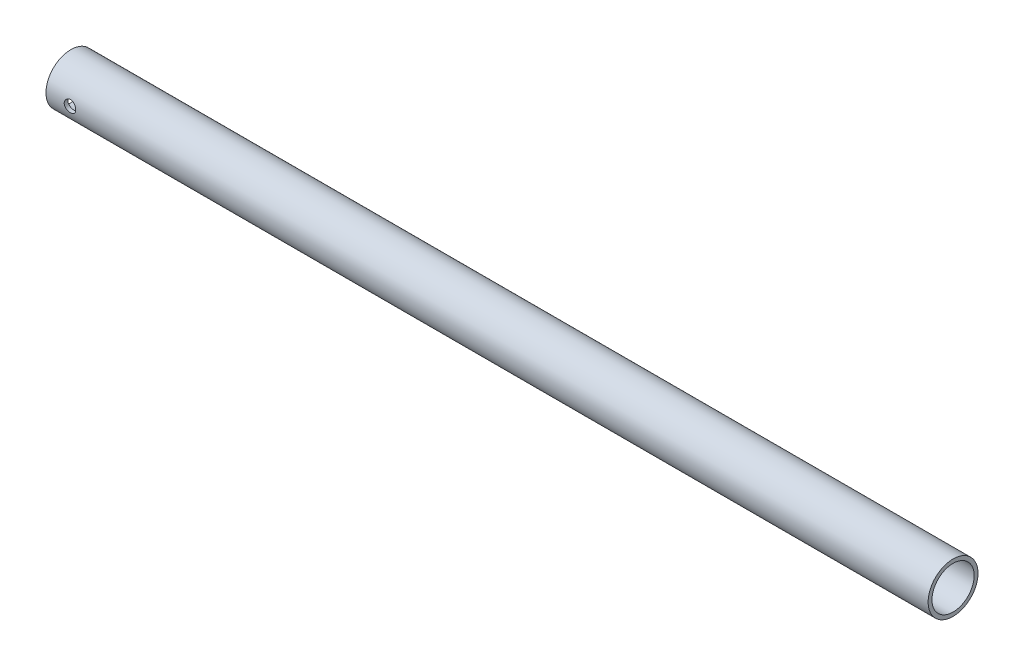
ISO-10303-21;
HEADER;
FILE_DESCRIPTION(('STEP AP214'),'2;1');
FILE_NAME('part.step','',(''),(''),'','','');
FILE_SCHEMA(('AUTOMOTIVE_DESIGN { 1 0 10303 214 1 1 1 1 }'));
ENDSEC;
DATA;
#1=APPLICATION_CONTEXT('core data for automotive mechanical design processes');
#2=APPLICATION_PROTOCOL_DEFINITION('international standard','automotive_design',2000,#1);
#3=PRODUCT_CONTEXT('',#1,'mechanical');
#4=PRODUCT('Part','Part','',(#3));
#5=PRODUCT_RELATED_PRODUCT_CATEGORY('part','',(#4));
#6=PRODUCT_DEFINITION_FORMATION('','',#4);
#7=PRODUCT_DEFINITION_CONTEXT('part definition',#1,'design');
#8=PRODUCT_DEFINITION('design','',#6,#7);
#9=PRODUCT_DEFINITION_SHAPE('','',#8);
#10=(LENGTH_UNIT() NAMED_UNIT(*) SI_UNIT(.MILLI.,.METRE.));
#11=(NAMED_UNIT(*) PLANE_ANGLE_UNIT() SI_UNIT($,.RADIAN.));
#12=(NAMED_UNIT(*) SI_UNIT($,.STERADIAN.) SOLID_ANGLE_UNIT());
#13=UNCERTAINTY_MEASURE_WITH_UNIT(LENGTH_MEASURE(1.E-05),#10,'distance_accuracy_value','');
#14=(GEOMETRIC_REPRESENTATION_CONTEXT(3) GLOBAL_UNCERTAINTY_ASSIGNED_CONTEXT((#13)) GLOBAL_UNIT_ASSIGNED_CONTEXT((#10,
#11,#12)) REPRESENTATION_CONTEXT('',''));
#15=CARTESIAN_POINT('',(0.,0.,0.));
#16=DIRECTION('',(0.,0.,1.));
#17=DIRECTION('',(1.,0.,0.));
#18=AXIS2_PLACEMENT_3D('',#15,#16,#17);
#19=CARTESIAN_POINT('',(460.,0.,0.));
#20=DIRECTION('',(-1.,0.,0.));
#21=DIRECTION('',(0.,0.,1.));
#22=AXIS2_PLACEMENT_3D('',#19,#20,#21);
#23=CYLINDRICAL_SURFACE('',#22,13.);
#24=CARTESIAN_POINT('',(440.,-13.,0.));
#25=CARTESIAN_POINT('',(440.000003596833,-12.9999989044515,0.083956314742746));
#26=CARTESIAN_POINT('',(440.007072415035,-12.999178081572,0.167966345196194));
#27=CARTESIAN_POINT('',(440.035161735033,-12.995982599614,0.333652235419384));
#28=CARTESIAN_POINT('',(440.056197134684,-12.9936062813601,0.415325505475668));
#29=CARTESIAN_POINT('',(440.111594666143,-12.9875677351869,0.573914972249237));
#30=CARTESIAN_POINT('',(440.145948204309,-12.9839063366207,0.650834199520714));
#31=CARTESIAN_POINT('',(440.226988881879,-12.9757057473599,0.797799793787156));
#32=CARTESIAN_POINT('',(440.273673767899,-12.9711667170809,0.867847413269135));
#33=CARTESIAN_POINT('',(440.378288035599,-12.9616943551208,0.999427807179251));
#34=CARTESIAN_POINT('',(440.436263947377,-12.9567594432832,1.06092347729186));
#35=CARTESIAN_POINT('',(440.561714836752,-12.9470643855765,1.17333502414499));
#36=CARTESIAN_POINT('',(440.629190279203,-12.9423042482743,1.22425038284192));
#37=CARTESIAN_POINT('',(440.771962663895,-12.9334819604022,1.31419168733341));
#38=CARTESIAN_POINT('',(440.847281360078,-12.9294218388056,1.35318331715732));
#39=CARTESIAN_POINT('',(441.003452161959,-12.9224797052987,1.41795120910941));
#40=CARTESIAN_POINT('',(441.084304087987,-12.9195976551562,1.44372790011128));
#41=CARTESIAN_POINT('',(441.248863524624,-12.9153528047108,1.48122247723769));
#42=CARTESIAN_POINT('',(441.332556673741,-12.9139832786549,1.49300261981051));
#43=CARTESIAN_POINT('',(441.500742439544,-12.9128978570991,1.50236226854618));
#44=CARTESIAN_POINT('',(441.585235028569,-12.9131819045903,1.49994226427629));
#45=CARTESIAN_POINT('',(441.752189313271,-12.9153653842397,1.48102150197297));
#46=CARTESIAN_POINT('',(441.834658869593,-12.9172569773873,1.46458907258955));
#47=CARTESIAN_POINT('',(441.995661894018,-12.9224301836669,1.41821640637188));
#48=CARTESIAN_POINT('',(442.074195293186,-12.9257118211342,1.38827593305338));
#49=CARTESIAN_POINT('',(442.225310469236,-12.9333043079058,1.31566282618379));
#50=CARTESIAN_POINT('',(442.297877729502,-12.9376175732259,1.27296024500288));
#51=CARTESIAN_POINT('',(442.434841729507,-12.9467853893456,1.176056552901));
#52=CARTESIAN_POINT('',(442.499238150506,-12.9516399612475,1.12185499363065));
#53=CARTESIAN_POINT('',(442.618429283808,-12.9613782949516,1.00311203599151));
#54=CARTESIAN_POINT('',(442.673165291298,-12.9662620604919,0.938511694342143));
#55=CARTESIAN_POINT('',(442.771025612168,-12.9754816969276,0.801008592236024));
#56=CARTESIAN_POINT('',(442.814149905067,-12.9798175668567,0.728105817136094));
#57=CARTESIAN_POINT('',(442.887561712845,-12.9874550212078,0.576023905679869));
#58=CARTESIAN_POINT('',(442.917845838429,-12.9907563324875,0.496843118716625));
#59=CARTESIAN_POINT('',(442.964672527342,-12.9959501177405,0.334473831095745));
#60=CARTESIAN_POINT('',(442.981215638363,-12.9978426478647,0.251285490311377));
#61=CARTESIAN_POINT('',(443.00001527638,-12.999998373659,0.0837704200050181));
#62=CARTESIAN_POINT('',(443.002352728932,-13.0002707984128,-0.000547113543201554));
#63=CARTESIAN_POINT('',(442.992887845389,-12.9991804669134,-0.168372695685013));
#64=CARTESIAN_POINT('',(442.981085764988,-12.9978177402298,-0.251880758889235));
#65=CARTESIAN_POINT('',(442.943744027192,-12.993616027243,-0.415480266956173));
#66=CARTESIAN_POINT('',(442.918242671291,-12.9907811576039,-0.495580568872908));
#67=CARTESIAN_POINT('',(442.854265903771,-12.9839527929212,-0.650367161714373));
#68=CARTESIAN_POINT('',(442.815790111836,-12.9799592639147,-0.72505329385713));
#69=CARTESIAN_POINT('',(442.726758854877,-12.9712363785455,-0.867254744569787));
#70=CARTESIAN_POINT('',(442.676150704087,-12.9665038451426,-0.934736878832498));
#71=CARTESIAN_POINT('',(442.564366255185,-12.9568430886348,-1.06027784673841));
#72=CARTESIAN_POINT('',(442.503189601551,-12.9519148589511,-1.11833636324621));
#73=CARTESIAN_POINT('',(442.371649614664,-12.9423899602444,-1.22366664140005));
#74=CARTESIAN_POINT('',(442.301243356491,-12.9377950067668,-1.27088497439799));
#75=CARTESIAN_POINT('',(442.153452424155,-12.9294843210235,-1.35282617315315));
#76=CARTESIAN_POINT('',(442.076067872123,-12.9257685733744,-1.38754925754464));
#77=CARTESIAN_POINT('',(441.916693846265,-12.9196483466479,-1.44342658284104));
#78=CARTESIAN_POINT('',(441.83471529207,-12.91724089246,-1.46461162925534));
#79=CARTESIAN_POINT('',(441.668335060486,-12.9140010380224,-1.49291104062266));
#80=CARTESIAN_POINT('',(441.583933478036,-12.9131685761467,-1.50002595610951));
#81=CARTESIAN_POINT('',(441.415634346241,-12.9131745631781,-1.49997405326831));
#82=CARTESIAN_POINT('',(441.331736758189,-12.9140031925958,-1.49289116482702));
#83=CARTESIAN_POINT('',(441.166332498007,-12.9172169582806,-1.46482172327173));
#84=CARTESIAN_POINT('',(441.084825827235,-12.9196020954322,-1.44383516225566));
#85=CARTESIAN_POINT('',(440.926523908311,-12.9256572251488,-1.38857911797314));
#86=CARTESIAN_POINT('',(440.849727457419,-12.9293268880955,-1.35431304208043));
#87=CARTESIAN_POINT('',(440.702961599612,-12.9375381901497,-1.27347900341467));
#88=CARTESIAN_POINT('',(440.632992227878,-12.9420798337501,-1.22691097725305));
#89=CARTESIAN_POINT('',(440.501437046671,-12.9515555600008,-1.12248173071089));
#90=CARTESIAN_POINT('',(440.439901078825,-12.9564917239034,-1.06455790771247));
#91=CARTESIAN_POINT('',(440.327388885109,-12.9661816355574,-0.939190054186261));
#92=CARTESIAN_POINT('',(440.276415167591,-12.9709353397599,-0.871743768617521));
#93=CARTESIAN_POINT('',(440.18633643593,-12.9797415177439,-0.728996893197065));
#94=CARTESIAN_POINT('',(440.147270694315,-12.9837916526637,-0.653671391511395));
#95=CARTESIAN_POINT('',(440.082396894961,-12.9907101076694,-0.497527270565871));
#96=CARTESIAN_POINT('',(440.056574207864,-12.993579731148,-0.416714824913402));
#97=CARTESIAN_POINT('',(440.025207145162,-12.9971099824635,-0.279556305332066));
#98=CARTESIAN_POINT('',(440.015767772866,-12.9981885527758,-0.224080319679976));
#99=CARTESIAN_POINT('',(440.003163014719,-12.9996339262189,-0.112410914672196));
#100=CARTESIAN_POINT('',(439.999997591546,-13.0000007335839,-0.0562174995863263));
#101=CARTESIAN_POINT('',(440.,-13.,0.));
#102=B_SPLINE_CURVE_WITH_KNOTS('',3,(#24,#25,#26,#27,#28,#29,#30,#31,#32,#33,#34,#35,#36,#37,
#38,#39,#40,#41,#42,#43,#44,#45,#46,#47,#48,#49,#50,#51,#52,#53,#54,#55,#56,#57,#58,#59,#60,#61,
#62,#63,#64,#65,#66,#67,#68,#69,#70,#71,#72,#73,#74,#75,#76,#77,#78,#79,#80,#81,#82,#83,#84,#85,
#86,#87,#88,#89,#90,#91,#92,#93,#94,#95,#96,#97,#98,#99,#100,#101),.UNSPECIFIED.,.T.,.F.,(4,2,2,
2,2,2,2,2,2,2,2,2,2,2,2,2,2,2,2,2,2,2,2,2,2,2,2,2,2,2,2,2,2,2,2,2,2,2,4),(0.,0.251663624421985,
0.503596125244182,0.755366334321114,1.00709056767774,1.25987498270026,1.51267177188703,
1.7661893968867,2.01969879377992,2.27207631201589,2.52444512928266,2.77559031440118,
3.02673989646919,3.2784835178068,3.53023695652511,3.78347119880921,4.03670588773478,
4.29000737900452,4.54329877367702,4.7951458771551,5.04698842639326,5.29813049175029,
5.54927991940206,5.80154039645168,6.05380936112802,6.30729621090911,6.56077862511557,
6.81368217226283,7.06657582364486,7.31797891068339,7.56938214060571,7.82072090595919,
8.07206096641747,8.32482769676539,8.57765438622375,8.83130609524243,9.0846769930563,
9.25319301127903,9.42170802703678),.UNSPECIFIED.);
#103=CARTESIAN_POINT('',(440.,-13.,0.));
#104=VERTEX_POINT('',#103);
#105=EDGE_CURVE('E61',#104,#104,#102,.T.);
#106=ORIENTED_EDGE('',*,*,#105,.T.);
#107=EDGE_LOOP('',(#106));
#108=FACE_BOUND('',#107,.T.);
#109=CARTESIAN_POINT('',(11.,-13.,0.));
#110=CARTESIAN_POINT('',(11.0000035968329,-12.9999989044515,0.0839563147427421));
#111=CARTESIAN_POINT('',(11.0070724150348,-12.999178081572,0.167966345196187));
#112=CARTESIAN_POINT('',(11.0351617350334,-12.995982599614,0.333652235419372));
#113=CARTESIAN_POINT('',(11.0561971346836,-12.9936062813601,0.415325505475653));
#114=CARTESIAN_POINT('',(11.1115946661428,-12.9875677351869,0.573914972249221));
#115=CARTESIAN_POINT('',(11.1459482043093,-12.9839063366207,0.650834199520699));
#116=CARTESIAN_POINT('',(11.2269888818787,-12.9757057473599,0.79779979378714));
#117=CARTESIAN_POINT('',(11.2736737678988,-12.9711667170809,0.867847413269117));
#118=CARTESIAN_POINT('',(11.3782880355988,-12.9616943551208,0.999427807179226));
#119=CARTESIAN_POINT('',(11.4362639473772,-12.9567594432832,1.06092347729183));
#120=CARTESIAN_POINT('',(11.5617148367524,-12.9470643855765,1.17333502414497));
#121=CARTESIAN_POINT('',(11.6291902792033,-12.9423042482743,1.2242503828419));
#122=CARTESIAN_POINT('',(11.7719626638952,-12.9334819604022,1.3141916873334));
#123=CARTESIAN_POINT('',(11.8472813600777,-12.9294218388056,1.3531833171573));
#124=CARTESIAN_POINT('',(12.0034521619588,-12.9224797052987,1.41795120910938));
#125=CARTESIAN_POINT('',(12.084304087987,-12.9195976551562,1.44372790011126));
#126=CARTESIAN_POINT('',(12.2488635246237,-12.9153528047108,1.48122247723766));
#127=CARTESIAN_POINT('',(12.3325566737406,-12.9139832786549,1.49300261981048));
#128=CARTESIAN_POINT('',(12.5007424395441,-12.9128978570991,1.50236226854616));
#129=CARTESIAN_POINT('',(12.5852350285688,-12.9131819045903,1.49994226427626));
#130=CARTESIAN_POINT('',(12.7521893132711,-12.9153653842397,1.48102150197295));
#131=CARTESIAN_POINT('',(12.8346588695926,-12.9172569773873,1.46458907258954));
#132=CARTESIAN_POINT('',(12.9956618940182,-12.9224301836669,1.41821640637187));
#133=CARTESIAN_POINT('',(13.0741952931857,-12.9257118211342,1.38827593305336));
#134=CARTESIAN_POINT('',(13.2253104692361,-12.9333043079058,1.31566282618376));
#135=CARTESIAN_POINT('',(13.2978777295023,-12.9376175732259,1.27296024500285));
#136=CARTESIAN_POINT('',(13.4348417295072,-12.9467853893456,1.17605655290097));
#137=CARTESIAN_POINT('',(13.4992381505055,-12.9516399612475,1.12185499363063));
#138=CARTESIAN_POINT('',(13.6184292838083,-12.9613782949516,1.0031120359915));
#139=CARTESIAN_POINT('',(13.6731652912979,-12.9662620604919,0.93851169434214));
#140=CARTESIAN_POINT('',(13.7710256121676,-12.9754816969276,0.80100859223603));
#141=CARTESIAN_POINT('',(13.8141499050673,-12.9798175668567,0.728105817136099));
#142=CARTESIAN_POINT('',(13.8875617128448,-12.9874550212078,0.57602390567987));
#143=CARTESIAN_POINT('',(13.9178458384286,-12.9907563324875,0.496843118716625));
#144=CARTESIAN_POINT('',(13.9646725273424,-12.9959501177405,0.334473831095743));
#145=CARTESIAN_POINT('',(13.981215638363,-12.9978426478647,0.251285490311374));
#146=CARTESIAN_POINT('',(14.0000152763796,-12.999998373659,0.083770420005017));
#147=CARTESIAN_POINT('',(14.0023527289319,-13.0002707984128,-0.00054711354320089));
#148=CARTESIAN_POINT('',(13.992887845389,-12.9991804669134,-0.168372695685007));
#149=CARTESIAN_POINT('',(13.9810857649878,-12.9978177402298,-0.251880758889224));
#150=CARTESIAN_POINT('',(13.943744027192,-12.993616027243,-0.415480266956157));
#151=CARTESIAN_POINT('',(13.9182426712912,-12.9907811576039,-0.495580568872891));
#152=CARTESIAN_POINT('',(13.854265903771,-12.9839527929212,-0.650367161714355));
#153=CARTESIAN_POINT('',(13.8157901118356,-12.9799592639147,-0.725053293857113));
#154=CARTESIAN_POINT('',(13.7267588548771,-12.9712363785455,-0.867254744569762));
#155=CARTESIAN_POINT('',(13.6761507040872,-12.9665038451426,-0.934736878832463));
#156=CARTESIAN_POINT('',(13.5643662551848,-12.9568430886348,-1.06027784673838));
#157=CARTESIAN_POINT('',(13.5031896015509,-12.9519148589511,-1.11833636324618));
#158=CARTESIAN_POINT('',(13.3716496146641,-12.9423899602444,-1.22366664140002));
#159=CARTESIAN_POINT('',(13.3012433564911,-12.9377950067668,-1.27088497439797));
#160=CARTESIAN_POINT('',(13.153452424155,-12.9294843210235,-1.35282617315314));
#161=CARTESIAN_POINT('',(13.0760678721235,-12.9257685733744,-1.38754925754463));
#162=CARTESIAN_POINT('',(12.9166938462645,-12.9196483466479,-1.44342658284102));
#163=CARTESIAN_POINT('',(12.8347152920696,-12.91724089246,-1.46461162925533));
#164=CARTESIAN_POINT('',(12.6683350604856,-12.9140010380224,-1.49291104062265));
#165=CARTESIAN_POINT('',(12.5839334780355,-12.9131685761468,-1.50002595610949));
#166=CARTESIAN_POINT('',(12.4156343462406,-12.9131745631781,-1.49997405326828));
#167=CARTESIAN_POINT('',(12.331736758189,-12.9140031925958,-1.49289116482699));
#168=CARTESIAN_POINT('',(12.1663324980068,-12.9172169582806,-1.46482172327171));
#169=CARTESIAN_POINT('',(12.084825827235,-12.9196020954323,-1.44383516225563));
#170=CARTESIAN_POINT('',(11.9265239083107,-12.9256572251488,-1.38857911797313));
#171=CARTESIAN_POINT('',(11.8497274574188,-12.9293268880955,-1.35431304208042));
#172=CARTESIAN_POINT('',(11.7029615996121,-12.9375381901497,-1.27347900341466));
#173=CARTESIAN_POINT('',(11.6329922278779,-12.9420798337501,-1.22691097725304));
#174=CARTESIAN_POINT('',(11.5014370466707,-12.9515555600008,-1.12248173071088));
#175=CARTESIAN_POINT('',(11.439901078825,-12.9564917239034,-1.06455790771248));
#176=CARTESIAN_POINT('',(11.3273888851092,-12.9661816355574,-0.939190054186289));
#177=CARTESIAN_POINT('',(11.2764151675912,-12.9709353397599,-0.871743768617548));
#178=CARTESIAN_POINT('',(11.1863364359297,-12.9797415177439,-0.728996893197091));
#179=CARTESIAN_POINT('',(11.1472706943146,-12.9837916526637,-0.653671391511422));
#180=CARTESIAN_POINT('',(11.0823968949605,-12.9907101076695,-0.497527270565883));
#181=CARTESIAN_POINT('',(11.0565742078644,-12.993579731148,-0.416714824913399));
#182=CARTESIAN_POINT('',(11.0252071451619,-12.9971099824635,-0.27955630533205));
#183=CARTESIAN_POINT('',(11.0157677728663,-12.9981885527758,-0.224080319679962));
#184=CARTESIAN_POINT('',(11.0031630147193,-12.9996339262189,-0.112410914672189));
#185=CARTESIAN_POINT('',(10.9999975915456,-13.0000007335839,-0.0562174995863225));
#186=CARTESIAN_POINT('',(11.,-13.,0.));
#187=B_SPLINE_CURVE_WITH_KNOTS('',3,(#109,#110,#111,#112,#113,#114,#115,#116,#117,#118,#119,
#120,#121,#122,#123,#124,#125,#126,#127,#128,#129,#130,#131,#132,#133,#134,#135,#136,#137,#138,
#139,#140,#141,#142,#143,#144,#145,#146,#147,#148,#149,#150,#151,#152,#153,#154,#155,#156,#157,
#158,#159,#160,#161,#162,#163,#164,#165,#166,#167,#168,#169,#170,#171,#172,#173,#174,#175,#176,
#177,#178,#179,#180,#181,#182,#183,#184,#185,#186),.UNSPECIFIED.,.T.,.F.,(4,2,2,2,2,2,2,2,2,2,2,
2,2,2,2,2,2,2,2,2,2,2,2,2,2,2,2,2,2,2,2,2,2,2,2,2,2,2,4),(0.,0.251663624421978,
0.503596125244171,0.75536633432109,1.00709056767771,1.25987498270023,1.51267177188699,
1.76618939688668,2.0196987937799,2.27207631201581,2.52444512928256,2.77559031440111,
3.02673989646913,3.27848351780672,3.53023695652505,3.78347119880911,4.0367058877347,
4.29000737900445,4.54329877367693,4.79514587715501,5.04698842639317,5.2981304917502,
5.54927991940194,5.80154039645154,6.05380936112789,6.30729621090899,6.56077862511548,
6.81368217226278,7.0665758236448,7.31797891068329,7.56938214060555,7.82072090595902,
8.07206096641734,8.32482769676521,8.57765438622356,8.83130609524227,9.08467699305618,
9.2531930112789,9.42170802703664),.UNSPECIFIED.);
#188=CARTESIAN_POINT('',(11.,-13.,0.));
#189=VERTEX_POINT('',#188);
#190=EDGE_CURVE('E60',#189,#189,#187,.T.);
#191=ORIENTED_EDGE('',*,*,#190,.T.);
#192=EDGE_LOOP('',(#191));
#193=FACE_BOUND('',#192,.T.);
#194=CARTESIAN_POINT('',(460.,0.,0.));
#195=DIRECTION('',(1.,0.,0.));
#196=DIRECTION('',(0.,0.,-1.));
#197=AXIS2_PLACEMENT_3D('',#194,#195,#196);
#198=CIRCLE('',#197,13.);
#199=CARTESIAN_POINT('',(460.,0.,-13.));
#200=VERTEX_POINT('',#199);
#201=EDGE_CURVE('E10',#200,#200,#198,.T.);
#202=ORIENTED_EDGE('',*,*,#201,.F.);
#203=EDGE_LOOP('',(#202));
#204=FACE_BOUND('',#203,.T.);
#205=CARTESIAN_POINT('',(0.,0.,0.));
#206=DIRECTION('',(1.,0.,0.));
#207=DIRECTION('',(0.,0.,-1.));
#208=AXIS2_PLACEMENT_3D('',#205,#206,#207);
#209=CIRCLE('',#208,13.);
#210=CARTESIAN_POINT('',(0.,0.,-13.));
#211=VERTEX_POINT('',#210);
#212=EDGE_CURVE('E44',#211,#211,#209,.T.);
#213=ORIENTED_EDGE('',*,*,#212,.T.);
#214=EDGE_LOOP('',(#213));
#215=FACE_BOUND('',#214,.T.);
#216=CARTESIAN_POINT('',(9.5,0.,13.));
#217=CARTESIAN_POINT('',(9.50000533071178,-0.166152344952669,12.9999969906573));
#218=CARTESIAN_POINT('',(9.51384985362218,-0.332367205973653,12.9967824842909));
#219=CARTESIAN_POINT('',(9.5687952857713,-0.660059866493254,12.9842700075106));
#220=CARTESIAN_POINT('',(9.6099141768828,-0.821534467366725,12.9749680237034));
#221=CARTESIAN_POINT('',(9.71803939788185,-1.13496480129888,12.9513142129353));
#222=CARTESIAN_POINT('',(9.78501717026269,-1.28693082086391,12.936967958219));
#223=CARTESIAN_POINT('',(9.94286453013673,-1.577465910561,12.904766336637));
#224=CARTESIAN_POINT('',(10.0337340374119,-1.71603502567188,12.8869109815535));
#225=CARTESIAN_POINT('',(10.2384905033544,-1.97830470624641,12.8492864660987));
#226=CARTESIAN_POINT('',(10.3527207234048,-2.10173358432239,12.8294913730764));
#227=CARTESIAN_POINT('',(10.6002198531428,-2.32786120795392,12.7903971901517));
#228=CARTESIAN_POINT('',(10.7334906163216,-2.43055793299827,12.7710981487534));
#229=CARTESIAN_POINT('',(11.01733385512,-2.61353391505111,12.7349234835873));
#230=CARTESIAN_POINT('',(11.1681008819513,-2.69351850955545,12.7180809816988));
#231=CARTESIAN_POINT('',(11.4813901973035,-2.82690790660153,12.6891009206901));
#232=CARTESIAN_POINT('',(11.6439109044991,-2.88031627708408,12.6769627300499));
#233=CARTESIAN_POINT('',(11.9731316031644,-2.95812848517193,12.659030692131));
#234=CARTESIAN_POINT('',(12.1397113467331,-2.98301618993589,12.6531311408672));
#235=CARTESIAN_POINT('',(12.4747781740707,-3.00458614092873,12.6480272975283));
#236=CARTESIAN_POINT('',(12.6432649925563,-3.00127226312641,12.6488220853967));
#237=CARTESIAN_POINT('',(12.9737256156487,-2.96692126571465,12.6569216667427));
#238=CARTESIAN_POINT('',(13.1357621626882,-2.93645150630372,12.6640932250769));
#239=CARTESIAN_POINT('',(13.4523595838029,-2.8495548295868,12.683927027642));
#240=CARTESIAN_POINT('',(13.6069199955541,-2.79312630925337,12.6965896109567));
#241=CARTESIAN_POINT('',(13.9057453432819,-2.65540698150097,12.726106644567));
#242=CARTESIAN_POINT('',(14.049908161822,-2.57390258493056,12.7429968648251));
#243=CARTESIAN_POINT('',(14.3227184725787,-2.3884949795051,12.7790447936328));
#244=CARTESIAN_POINT('',(14.451363620518,-2.2845883929106,12.7982028439228));
#245=CARTESIAN_POINT('',(14.6927479001019,-2.05434642172905,12.8371955528176));
#246=CARTESIAN_POINT('',(14.8050277702499,-1.92752990169011,12.8570353769547));
#247=CARTESIAN_POINT('',(15.0068061419507,-1.65663728210681,12.8947363213875));
#248=CARTESIAN_POINT('',(15.0963041350972,-1.51256079749006,12.91259739752));
#249=CARTESIAN_POINT('',(15.2501118282866,-1.21064255594474,12.94439708166));
#250=CARTESIAN_POINT('',(15.3143560313853,-1.0527662865885,12.9583254640484));
#251=CARTESIAN_POINT('',(15.4152722873901,-0.728064792505165,12.980615159728));
#252=CARTESIAN_POINT('',(15.4519488147769,-0.561241024748474,12.9889773764326));
#253=CARTESIAN_POINT('',(15.4960083006963,-0.22731464786328,12.999062058904));
#254=CARTESIAN_POINT('',(15.5040178721195,-0.0602988900254581,13.0009265305377));
#255=CARTESIAN_POINT('',(15.4922219704814,0.272684743158449,12.9982059982626));
#256=CARTESIAN_POINT('',(15.472418609864,0.438652697125492,12.9936214841662));
#257=CARTESIAN_POINT('',(15.4060776067885,0.762715807596045,12.9786082469926));
#258=CARTESIAN_POINT('',(15.3598735173657,0.920882929751393,12.968252478837));
#259=CARTESIAN_POINT('',(15.2424168221512,1.22721924496333,12.9428582085761));
#260=CARTESIAN_POINT('',(15.1711619237282,1.3753875214532,12.9278192778858));
#261=CARTESIAN_POINT('',(15.0043547121581,1.66007523022035,12.8943799217624));
#262=CARTESIAN_POINT('',(14.9084406162299,1.79637682059256,12.8759307059183));
#263=CARTESIAN_POINT('',(14.6955087652826,2.05117436096366,12.8378078382851));
#264=CARTESIAN_POINT('',(14.5784879369158,2.16966771329558,12.8181340084537));
#265=CARTESIAN_POINT('',(14.3237752282431,2.38800205666,12.7792809496474));
#266=CARTESIAN_POINT('',(14.1857060706494,2.48740687177955,12.7601203499969));
#267=CARTESIAN_POINT('',(13.8944682395653,2.66162470892946,12.7249237700036));
#268=CARTESIAN_POINT('',(13.7413002379075,2.73643882449717,12.7088876507294));
#269=CARTESIAN_POINT('',(13.4250480231647,2.85882133736006,12.6819190230073));
#270=CARTESIAN_POINT('',(13.262027740679,2.90654808960746,12.6709569224205));
#271=CARTESIAN_POINT('',(12.9299920143535,2.9738506135118,12.6553320099168));
#272=CARTESIAN_POINT('',(12.7609776616361,2.99343148198756,12.6506680575041));
#273=CARTESIAN_POINT('',(12.4261635458855,3.00365072031913,12.6482450687886));
#274=CARTESIAN_POINT('',(12.2603857787004,2.99498255743034,12.6503205850391));
#275=CARTESIAN_POINT('',(11.9327226426661,2.95051371961671,12.6607654071459));
#276=CARTESIAN_POINT('',(11.7708372167854,2.91471344248812,12.6691346207273));
#277=CARTESIAN_POINT('',(11.4561801784171,2.81734841440311,12.6911387833219));
#278=CARTESIAN_POINT('',(11.3033722785881,2.7558954206715,12.7047508718617));
#279=CARTESIAN_POINT('',(11.0101363869175,2.60906164454194,12.7357136622437));
#280=CARTESIAN_POINT('',(10.8697098517453,2.52367805163026,12.7530648031611));
#281=CARTESIAN_POINT('',(10.6018289428198,2.32915359032528,12.7900365874876));
#282=CARTESIAN_POINT('',(10.4747357609008,2.21952324066575,12.8096993736488));
#283=CARTESIAN_POINT('',(10.2405235047234,1.98059542918642,12.8488080487622));
#284=CARTESIAN_POINT('',(10.1334090901394,1.85129339204876,12.8682538861233));
#285=CARTESIAN_POINT('',(9.94066546410237,1.57438386552311,12.9050799859908));
#286=CARTESIAN_POINT('',(9.85537776342045,1.42653373816977,12.9224254113505));
#287=CARTESIAN_POINT('',(9.71100170118278,1.11821928295074,12.9527409110575));
#288=CARTESIAN_POINT('',(9.65189252979414,0.957765094203868,12.9657144587282));
#289=CARTESIAN_POINT('',(9.57144305288853,0.664420748397534,12.9836544679345));
#290=CARTESIAN_POINT('',(9.54470545794599,0.533052734642015,12.989744579336));
#291=CARTESIAN_POINT('',(9.50898226677056,0.267803260561669,12.9979184490222));
#292=CARTESIAN_POINT('',(9.49999570334532,0.13392193757966,13.0000024255872));
#293=CARTESIAN_POINT('',(9.5,0.,13.));
#294=B_SPLINE_CURVE_WITH_KNOTS('',3,(#216,#217,#218,#219,#220,#221,#222,#223,#224,#225,#226,
#227,#228,#229,#230,#231,#232,#233,#234,#235,#236,#237,#238,#239,#240,#241,#242,#243,#244,#245,
#246,#247,#248,#249,#250,#251,#252,#253,#254,#255,#256,#257,#258,#259,#260,#261,#262,#263,#264,
#265,#266,#267,#268,#269,#270,#271,#272,#273,#274,#275,#276,#277,#278,#279,#280,#281,#282,#283,
#284,#285,#286,#287,#288,#289,#290,#291,#292,#293),.UNSPECIFIED.,.T.,.F.,(4,2,2,2,2,2,2,2,2,2,2,
2,2,2,2,2,2,2,2,2,2,2,2,2,2,2,2,2,2,2,2,2,2,2,2,2,2,2,4),(0.,0.497966622434228,
0.996261878862197,1.49400840494549,1.9917532598344,2.49741860444443,3.00313320634928,
3.51513680218821,4.02707164139241,4.53018632285288,5.03323185836015,5.52600755521466,
6.01881368645778,6.51593939429341,7.01314010983494,7.52235052563831,8.03157230411895,
8.54210619550814,9.05255720476822,9.55178002870641,10.0509649377955,10.5439782351976,
11.0370366645577,11.5377886750691,12.0386136589454,12.5497908111456,13.0609452284513,
13.5690797726974,14.0771222894149,14.5727880288599,15.0684465012649,15.5619677862172,
16.0555470567626,16.5601864742807,17.0649434427466,17.5771721946325,18.088993031651,
18.4903854337741,18.8917559648093),.UNSPECIFIED.);
#295=CARTESIAN_POINT('',(9.5,0.,13.));
#296=VERTEX_POINT('',#295);
#297=EDGE_CURVE('E103',#296,#296,#294,.T.);
#298=ORIENTED_EDGE('',*,*,#297,.F.);
#299=EDGE_LOOP('',(#298));
#300=FACE_BOUND('',#299,.T.);
#301=ADVANCED_FACE('F32',(#108,#193,#204,#215,#300),#23,.T.);
#302=CARTESIAN_POINT('',(460.,0.,0.));
#303=DIRECTION('',(-1.,0.,0.));
#304=DIRECTION('',(0.,0.,1.));
#305=AXIS2_PLACEMENT_3D('',#302,#303,#304);
#306=CYLINDRICAL_SURFACE('',#305,11.);
#307=CARTESIAN_POINT('',(0.,0.,0.));
#308=DIRECTION('',(1.,0.,0.));
#309=DIRECTION('',(0.,0.,-1.));
#310=AXIS2_PLACEMENT_3D('',#307,#308,#309);
#311=CIRCLE('',#310,11.);
#312=CARTESIAN_POINT('',(0.,0.,-11.));
#313=VERTEX_POINT('',#312);
#314=EDGE_CURVE('E52',#313,#313,#311,.T.);
#315=ORIENTED_EDGE('',*,*,#314,.F.);
#316=EDGE_LOOP('',(#315));
#317=FACE_BOUND('',#316,.T.);
#318=CARTESIAN_POINT('',(460.,0.,0.));
#319=DIRECTION('',(1.,0.,0.));
#320=DIRECTION('',(0.,0.,-1.));
#321=AXIS2_PLACEMENT_3D('',#318,#319,#320);
#322=CIRCLE('',#321,11.);
#323=CARTESIAN_POINT('',(460.,0.,-11.));
#324=VERTEX_POINT('',#323);
#325=EDGE_CURVE('E49',#324,#324,#322,.T.);
#326=ORIENTED_EDGE('',*,*,#325,.T.);
#327=EDGE_LOOP('',(#326));
#328=FACE_BOUND('',#327,.T.);
#329=CARTESIAN_POINT('',(12.5,-10.8972473588517,1.5));
#330=CARTESIAN_POINT('',(12.5838343278907,-10.8972486564246,1.49999647698957));
#331=CARTESIAN_POINT('',(12.6677194427675,-10.8982252418974,1.49294806758788));
#332=CARTESIAN_POINT('',(12.8331504746846,-10.9020240848212,1.46494465313417));
#333=CARTESIAN_POINT('',(12.9146939300249,-10.9048482153533,1.44397553464775));
#334=CARTESIAN_POINT('',(13.0730227855142,-10.9120164610863,1.38876442813267));
#335=CARTESIAN_POINT('',(13.149811551595,-10.9163594862124,1.35453195700279));
#336=CARTESIAN_POINT('',(13.2965419687474,-10.9260748678034,1.27378718150828));
#337=CARTESIAN_POINT('',(13.3664846890653,-10.9314470631389,1.2272767989718));
#338=CARTESIAN_POINT('',(13.4980145949851,-10.9426553719722,1.12296630775039));
#339=CARTESIAN_POINT('',(13.5595497603359,-10.9484940481324,1.06510087202417));
#340=CARTESIAN_POINT('',(13.6720678056857,-10.9599544812632,0.939863725934495));
#341=CARTESIAN_POINT('',(13.7230501373424,-10.9655762269495,0.872491521889764));
#342=CARTESIAN_POINT('',(13.8132044048967,-10.9759958911667,0.729823366821417));
#343=CARTESIAN_POINT('',(13.8523288765719,-10.9807904666082,0.654497157455733));
#344=CARTESIAN_POINT('',(13.9173525681087,-10.9889873043899,0.498266779811101));
#345=CARTESIAN_POINT('',(13.9432523683807,-10.9923896278325,0.4173628565063));
#346=CARTESIAN_POINT('',(13.980935031966,-10.9974005480408,0.252807513813705));
#347=CARTESIAN_POINT('',(13.9928046958514,-10.9990201695525,0.169176312601212));
#348=CARTESIAN_POINT('',(14.0023593809641,-11.0003209080163,0.00109450994932823));
#349=CARTESIAN_POINT('',(14.0000450600497,-11.0000021148727,-0.0833560533063686));
#350=CARTESIAN_POINT('',(13.9813665724136,-10.9974708146634,-0.250088067047744));
#351=CARTESIAN_POINT('',(13.9650957704841,-10.9952708921097,-0.332380194950618));
#352=CARTESIAN_POINT('',(13.9191123989843,-10.9892385808313,-0.493054984329789));
#353=CARTESIAN_POINT('',(13.8893995336958,-10.9854061561926,-0.571437559755948));
#354=CARTESIAN_POINT('',(13.8172777975102,-10.9765177622817,-0.722354501083415));
#355=CARTESIAN_POINT('',(13.7748289992064,-10.9714579548357,-0.794869550825005));
#356=CARTESIAN_POINT('',(13.678469450547,-10.9606799547905,-0.93178232970168));
#357=CARTESIAN_POINT('',(13.6245580752574,-10.9549617263023,-0.996179615955343));
#358=CARTESIAN_POINT('',(13.5062819940797,-10.9434509857673,-1.11557819561425));
#359=CARTESIAN_POINT('',(13.441835852491,-10.9376582477788,-1.17049882841786));
#360=CARTESIAN_POINT('',(13.3045980406632,-10.9266970216767,-1.26875693038294));
#361=CARTESIAN_POINT('',(13.2318063344713,-10.9215285362526,-1.31209434964114));
#362=CARTESIAN_POINT('',(13.079866549199,-10.9124011549528,-1.38596314565063));
#363=CARTESIAN_POINT('',(13.0007149016157,-10.9084429442205,-1.41648727235608));
#364=CARTESIAN_POINT('',(12.8383429694276,-10.9021970767288,-1.46378734808377));
#365=CARTESIAN_POINT('',(12.7551229200225,-10.8999093235195,-1.48056409086712));
#366=CARTESIAN_POINT('',(12.5876911564931,-10.8972813444562,-1.49978470836059));
#367=CARTESIAN_POINT('',(12.5034927483805,-10.8969256464885,-1.50234245427448));
#368=CARTESIAN_POINT('',(12.3358685820668,-10.8981610658356,-1.4933536614655));
#369=CARTESIAN_POINT('',(12.252442804228,-10.8997521335324,-1.48180748221547));
#370=CARTESIAN_POINT('',(12.0890782674211,-10.9046876535817,-1.44503477726887));
#371=CARTESIAN_POINT('',(12.0091267072538,-10.9080249489812,-1.41986407756188));
#372=CARTESIAN_POINT('',(11.8545782753703,-10.9160710546304,-1.35661456156867));
#373=CARTESIAN_POINT('',(11.7799816254042,-10.9207799216371,-1.31853521110031));
#374=CARTESIAN_POINT('',(11.6377473937773,-10.9310754038899,-1.23027212104658));
#375=CARTESIAN_POINT('',(11.5701562838736,-10.9366673277264,-1.18001412272531));
#376=CARTESIAN_POINT('',(11.4443274975657,-10.9480824916708,-1.06892459273349));
#377=CARTESIAN_POINT('',(11.3860902560991,-10.9539057425194,-1.00809256966386));
#378=CARTESIAN_POINT('',(11.2802184731906,-10.9651753220023,-0.877082587451357));
#379=CARTESIAN_POINT('',(11.2326590355375,-10.9706188057852,-0.806843655242674));
#380=CARTESIAN_POINT('',(11.1500141109612,-10.9804722800966,-0.659307817820868));
#381=CARTESIAN_POINT('',(11.114928332619,-10.9848822947688,-0.582011077550602));
#382=CARTESIAN_POINT('',(11.0583489740715,-10.9921593898812,-0.422796808531943));
#383=CARTESIAN_POINT('',(11.0368130063536,-10.9950312777662,-0.3408945717743));
#384=CARTESIAN_POINT('',(11.0078069923239,-10.9989285965487,-0.174594562810504));
#385=CARTESIAN_POINT('',(11.0003361847804,-10.9999541273742,-0.0901969259110155));
#386=CARTESIAN_POINT('',(10.9996886672288,-11.0000424834893,0.0779669723968891));
#387=CARTESIAN_POINT('',(11.0063965431173,-10.9991211561704,0.1617328042735));
#388=CARTESIAN_POINT('',(11.0336702656386,-10.9954510037266,0.326934263752212));
#389=CARTESIAN_POINT('',(11.054236088887,-10.9927021816854,0.408369895286135));
#390=CARTESIAN_POINT('',(11.1086035927957,-10.9856844439666,0.566576938829312));
#391=CARTESIAN_POINT('',(11.1423986661649,-10.9814162872104,0.643350657134411));
#392=CARTESIAN_POINT('',(11.2222533022405,-10.9718308359542,0.790155796425701));
#393=CARTESIAN_POINT('',(11.2683131216438,-10.9665135194962,0.860187076253162));
#394=CARTESIAN_POINT('',(11.3718127867224,-10.9553706532258,0.992107364302226));
#395=CARTESIAN_POINT('',(11.4293382679605,-10.9495414757205,1.0539288846877));
#396=CARTESIAN_POINT('',(11.5539568779909,-10.9380600025812,1.16708474239231));
#397=CARTESIAN_POINT('',(11.6210522588865,-10.932407748966,1.21841660422232));
#398=CARTESIAN_POINT('',(11.7632648466861,-10.9218923119176,1.30934306690393));
#399=CARTESIAN_POINT('',(11.8384175458287,-10.9170328791242,1.34888257108231));
#400=CARTESIAN_POINT('',(11.9943237923499,-10.908697184169,1.41472146000491));
#401=CARTESIAN_POINT('',(12.0750712632288,-10.905219448162,1.44103496081361));
#402=CARTESIAN_POINT('',(12.2135113982389,-10.9008677643293,1.47351601613));
#403=CARTESIAN_POINT('',(12.2703382111968,-10.899517060162,1.4834328389276));
#404=CARTESIAN_POINT('',(12.3847686885623,-10.8977064157816,1.49667600965627));
#405=CARTESIAN_POINT('',(12.4423723454053,-10.897246466901,1.50000242171475));
#406=CARTESIAN_POINT('',(12.5,-10.8972473588517,1.5));
#407=B_SPLINE_CURVE_WITH_KNOTS('',3,(#329,#330,#331,#332,#333,#334,#335,#336,#337,#338,#339,
#340,#341,#342,#343,#344,#345,#346,#347,#348,#349,#350,#351,#352,#353,#354,#355,#356,#357,#358,
#359,#360,#361,#362,#363,#364,#365,#366,#367,#368,#369,#370,#371,#372,#373,#374,#375,#376,#377,
#378,#379,#380,#381,#382,#383,#384,#385,#386,#387,#388,#389,#390,#391,#392,#393,#394,#395,#396,
#397,#398,#399,#400,#401,#402,#403,#404,#405,#406),.UNSPECIFIED.,.T.,.F.,(4,2,2,2,2,2,2,2,2,2,2,
2,2,2,2,2,2,2,2,2,2,2,2,2,2,2,2,2,2,2,2,2,2,2,2,2,2,2,4),(0.,0.251292413652352,
0.502839988614744,0.754207403054463,1.00553549494109,1.25835430174808,1.51118624213233,
1.76501723524539,2.01883708715133,2.27107826705025,2.52330774799944,2.77386293073417,
3.02442362581395,3.27577819064359,3.5271464627132,3.78055871311719,4.03397205526461,
4.28752859167035,4.5410704869265,4.79257896376821,5.04408103043815,5.29456029222846,
5.5450499205463,5.79710712919646,6.04917605465383,6.30296596167166,6.55674993906902,
6.80973601099934,7.0627083904752,7.31362951480923,7.56455021573112,7.81534575497387,
8.06614654369506,8.31889590223292,8.57170483921672,8.82567709259417,9.07937770366513,
9.25211760261269,9.42485582072184),.UNSPECIFIED.);
#408=CARTESIAN_POINT('',(12.5,-10.8972473588517,1.5));
#409=VERTEX_POINT('',#408);
#410=EDGE_CURVE('E55',#409,#409,#407,.T.);
#411=ORIENTED_EDGE('',*,*,#410,.F.);
#412=EDGE_LOOP('',(#411));
#413=FACE_BOUND('',#412,.T.);
#414=CARTESIAN_POINT('',(441.5,-10.8972473588517,1.50000000000002));
#415=CARTESIAN_POINT('',(441.583834327891,-10.8972486564246,1.49999647698959));
#416=CARTESIAN_POINT('',(441.667719442768,-10.8982252418974,1.49294806758791));
#417=CARTESIAN_POINT('',(441.833150474685,-10.9020240848212,1.4649446531342));
#418=CARTESIAN_POINT('',(441.914693930025,-10.9048482153533,1.44397553464778));
#419=CARTESIAN_POINT('',(442.073022785514,-10.9120164610863,1.3887644281327));
#420=CARTESIAN_POINT('',(442.149811551595,-10.9163594862124,1.35453195700282));
#421=CARTESIAN_POINT('',(442.296541968747,-10.9260748678034,1.27378718150832));
#422=CARTESIAN_POINT('',(442.366484689065,-10.9314470631388,1.22727679897184));
#423=CARTESIAN_POINT('',(442.498014594985,-10.9426553719722,1.12296630775043));
#424=CARTESIAN_POINT('',(442.559549760336,-10.9484940481324,1.06510087202421));
#425=CARTESIAN_POINT('',(442.672067805686,-10.9599544812632,0.939863725934544));
#426=CARTESIAN_POINT('',(442.723050137342,-10.9655762269495,0.872491521889814));
#427=CARTESIAN_POINT('',(442.813204404897,-10.9759958911667,0.729823366821471));
#428=CARTESIAN_POINT('',(442.852328876572,-10.9807904666082,0.654497157455789));
#429=CARTESIAN_POINT('',(442.917352568109,-10.9889873043899,0.498266779811155));
#430=CARTESIAN_POINT('',(442.943252368381,-10.9923896278325,0.417362856506349));
#431=CARTESIAN_POINT('',(442.980935031966,-10.9974005480408,0.252807513813746));
#432=CARTESIAN_POINT('',(442.992804695851,-10.9990201695525,0.169176312601251));
#433=CARTESIAN_POINT('',(443.002359380964,-11.0003209080163,0.00109450994936148));
#434=CARTESIAN_POINT('',(443.00004506005,-11.0000021148727,-0.0833560533063385));
#435=CARTESIAN_POINT('',(442.981366572414,-10.9974708146634,-0.250088067047722));
#436=CARTESIAN_POINT('',(442.965095770484,-10.9952708921097,-0.3323801949506));
#437=CARTESIAN_POINT('',(442.919112398984,-10.9892385808313,-0.493054984329777));
#438=CARTESIAN_POINT('',(442.889399533696,-10.9854061561926,-0.571437559755938));
#439=CARTESIAN_POINT('',(442.81727779751,-10.9765177622817,-0.722354501083411));
#440=CARTESIAN_POINT('',(442.774828999206,-10.9714579548358,-0.794869550825006));
#441=CARTESIAN_POINT('',(442.678469450547,-10.9606799547905,-0.931782329701684));
#442=CARTESIAN_POINT('',(442.624558075257,-10.9549617263022,-0.996179615955348));
#443=CARTESIAN_POINT('',(442.50628199408,-10.9434509857673,-1.11557819561425));
#444=CARTESIAN_POINT('',(442.441835852491,-10.9376582477788,-1.17049882841786));
#445=CARTESIAN_POINT('',(442.304598040663,-10.9266970216767,-1.26875693038294));
#446=CARTESIAN_POINT('',(442.231806334471,-10.9215285362526,-1.31209434964115));
#447=CARTESIAN_POINT('',(442.079866549199,-10.9124011549528,-1.38596314565065));
#448=CARTESIAN_POINT('',(442.000714901616,-10.9084429442205,-1.4164872723561));
#449=CARTESIAN_POINT('',(441.838342969428,-10.9021970767287,-1.46378734808378));
#450=CARTESIAN_POINT('',(441.755122920023,-10.8999093235195,-1.48056409086714));
#451=CARTESIAN_POINT('',(441.587691156493,-10.8972813444562,-1.49978470836062));
#452=CARTESIAN_POINT('',(441.50349274838,-10.8969256464884,-1.50234245427451));
#453=CARTESIAN_POINT('',(441.335868582067,-10.8981610658356,-1.49335366146552));
#454=CARTESIAN_POINT('',(441.252442804228,-10.8997521335324,-1.48180748221549));
#455=CARTESIAN_POINT('',(441.089078267421,-10.9046876535817,-1.4450347772689));
#456=CARTESIAN_POINT('',(441.009126707254,-10.9080249489812,-1.41986407756191));
#457=CARTESIAN_POINT('',(440.85457827537,-10.9160710546304,-1.35661456156871));
#458=CARTESIAN_POINT('',(440.779981625404,-10.9207799216371,-1.31853521110036));
#459=CARTESIAN_POINT('',(440.637747393777,-10.9310754038899,-1.23027212104663));
#460=CARTESIAN_POINT('',(440.570156283874,-10.9366673277264,-1.18001412272537));
#461=CARTESIAN_POINT('',(440.444327497566,-10.9480824916708,-1.06892459273354));
#462=CARTESIAN_POINT('',(440.386090256099,-10.9539057425194,-1.00809256966389));
#463=CARTESIAN_POINT('',(440.280218473191,-10.9651753220023,-0.877082587451372));
#464=CARTESIAN_POINT('',(440.232659035537,-10.9706188057852,-0.806843655242688));
#465=CARTESIAN_POINT('',(440.150014110961,-10.9804722800966,-0.659307817820889));
#466=CARTESIAN_POINT('',(440.114928332619,-10.9848822947688,-0.58201107755063));
#467=CARTESIAN_POINT('',(440.058348974071,-10.9921593898812,-0.422796808531974));
#468=CARTESIAN_POINT('',(440.036813006354,-10.9950312777662,-0.340894571774326));
#469=CARTESIAN_POINT('',(440.007806992324,-10.9989285965487,-0.174594562810524));
#470=CARTESIAN_POINT('',(440.00033618478,-10.9999541273742,-0.0901969259110341));
#471=CARTESIAN_POINT('',(439.999688667229,-11.0000424834893,0.0779669723968674));
#472=CARTESIAN_POINT('',(440.006396543117,-10.9991211561704,0.161732804273474));
#473=CARTESIAN_POINT('',(440.033670265639,-10.9954510037266,0.32693426375219));
#474=CARTESIAN_POINT('',(440.054236088887,-10.9927021816854,0.408369895286121));
#475=CARTESIAN_POINT('',(440.108603592796,-10.9856844439666,0.566576938829298));
#476=CARTESIAN_POINT('',(440.142398666165,-10.9814162872104,0.643350657134388));
#477=CARTESIAN_POINT('',(440.22225330224,-10.9718308359542,0.79015579642568));
#478=CARTESIAN_POINT('',(440.268313121644,-10.9665135194962,0.860187076253151));
#479=CARTESIAN_POINT('',(440.371812786722,-10.9553706532258,0.99210736430222));
#480=CARTESIAN_POINT('',(440.42933826796,-10.9495414757205,1.05392888468769));
#481=CARTESIAN_POINT('',(440.553956877991,-10.9380600025812,1.1670847423923));
#482=CARTESIAN_POINT('',(440.621052258886,-10.932407748966,1.21841660422233));
#483=CARTESIAN_POINT('',(440.763264846686,-10.9218923119176,1.30934306690395));
#484=CARTESIAN_POINT('',(440.838417545829,-10.9170328791241,1.34888257108233));
#485=CARTESIAN_POINT('',(440.99432379235,-10.908697184169,1.41472146000493));
#486=CARTESIAN_POINT('',(441.075071263229,-10.905219448162,1.44103496081363));
#487=CARTESIAN_POINT('',(441.213511398239,-10.9008677643293,1.47351601613002));
#488=CARTESIAN_POINT('',(441.270338211197,-10.8995170601619,1.48343283892762));
#489=CARTESIAN_POINT('',(441.384768688562,-10.8977064157815,1.4966760096563));
#490=CARTESIAN_POINT('',(441.442372345405,-10.897246466901,1.50000242171477));
#491=CARTESIAN_POINT('',(441.5,-10.8972473588517,1.50000000000002));
#492=B_SPLINE_CURVE_WITH_KNOTS('',3,(#414,#415,#416,#417,#418,#419,#420,#421,#422,#423,#424,
#425,#426,#427,#428,#429,#430,#431,#432,#433,#434,#435,#436,#437,#438,#439,#440,#441,#442,#443,
#444,#445,#446,#447,#448,#449,#450,#451,#452,#453,#454,#455,#456,#457,#458,#459,#460,#461,#462,
#463,#464,#465,#466,#467,#468,#469,#470,#471,#472,#473,#474,#475,#476,#477,#478,#479,#480,#481,
#482,#483,#484,#485,#486,#487,#488,#489,#490,#491),.UNSPECIFIED.,.T.,.F.,(4,2,2,2,2,2,2,2,2,2,2,
2,2,2,2,2,2,2,2,2,2,2,2,2,2,2,2,2,2,2,2,2,2,2,2,2,2,2,4),(0.,0.251292413652341,0.50283998861474,
0.754207403054393,1.0055354949411,1.25835430174807,1.5111862421323,1.76501723524535,
2.01883708715131,2.27107826705025,2.52330774799944,2.77386293073417,3.02442362581397,
3.27577819064364,3.52714646271323,3.7805587131172,4.03397205526462,4.2875285916704,
4.54107048692653,4.79257896376828,5.04408103043821,5.29456029222848,5.54504992054629,
5.79710712919647,6.0491760546539,6.30296596167173,6.55674993906909,6.80973601099942,
7.06270839047527,7.3136295148093,7.56455021573119,7.81534575497395,8.06614654369512,
8.31889590223302,8.57170483921682,8.8256770925943,9.07937770366522,9.25211760261283,
9.42485582072197),.UNSPECIFIED.);
#493=CARTESIAN_POINT('',(441.5,-10.8972473588517,1.50000000000002));
#494=VERTEX_POINT('',#493);
#495=EDGE_CURVE('E62',#494,#494,#492,.T.);
#496=ORIENTED_EDGE('',*,*,#495,.F.);
#497=EDGE_LOOP('',(#496));
#498=FACE_BOUND('',#497,.T.);
#499=CARTESIAN_POINT('',(15.5,0.,11.));
#500=CARTESIAN_POINT('',(15.499996374778,0.165241826664386,10.9999976543482));
#501=CARTESIAN_POINT('',(15.4863018728332,0.330521957625414,10.9962401452152));
#502=CARTESIAN_POINT('',(15.4319883393936,0.656311860315393,10.981615961709));
#503=CARTESIAN_POINT('',(15.3913572167428,0.816819455954529,10.97074609481));
#504=CARTESIAN_POINT('',(15.2845965365231,1.12831525211079,10.9430954434827));
#505=CARTESIAN_POINT('',(15.2185006946762,1.27931573394033,10.9263224773879));
#506=CARTESIAN_POINT('',(15.0628141346752,1.56808899231944,10.888633088257));
#507=CARTESIAN_POINT('',(14.9732215672921,1.70586072657955,10.8677163391303));
#508=CARTESIAN_POINT('',(14.7708003270655,1.96759389514652,10.8234279408412));
#509=CARTESIAN_POINT('',(14.6575091182916,2.09119025833987,10.8000128298086));
#510=CARTESIAN_POINT('',(14.4118947279402,2.31788587364956,10.7536422587013));
#511=CARTESIAN_POINT('',(14.2795689791954,2.42098235649443,10.7306868611041));
#512=CARTESIAN_POINT('',(13.9966975048411,2.60555589078995,10.6873876832732));
#513=CARTESIAN_POINT('',(13.8458657101274,2.68660853675173,10.6670986011725));
#514=CARTESIAN_POINT('',(13.5320723436012,2.82205832722455,10.6320701482383));
#515=CARTESIAN_POINT('',(13.369113130223,2.87646063893688,10.6173297017151));
#516=CARTESIAN_POINT('',(13.0397442099751,2.95578912882535,10.5955169438548));
#517=CARTESIAN_POINT('',(12.8735061036762,2.98137921086458,10.5882722456757));
#518=CARTESIAN_POINT('',(12.5389506339824,3.00442728818267,10.5817565816817));
#519=CARTESIAN_POINT('',(12.370633685,3.00189080281765,10.5824840514652));
#520=CARTESIAN_POINT('',(12.0419168980675,2.96928383560602,10.5916764975091));
#521=CARTESIAN_POINT('',(11.8814295307955,2.94002147337864,10.5999143662734));
#522=CARTESIAN_POINT('',(11.5677334279544,2.85608967743614,10.6228351158812));
#523=CARTESIAN_POINT('',(11.4145252990674,2.80141813009295,10.6375185328831));
#524=CARTESIAN_POINT('',(11.1176529589051,2.6675725965294,10.6718723658465));
#525=CARTESIAN_POINT('',(10.9741215979328,2.58811903765895,10.6915991952828));
#526=CARTESIAN_POINT('',(10.7021471051807,2.40715976044348,10.7337873759558));
#527=CARTESIAN_POINT('',(10.5737070743225,2.30564952212418,10.756249287265));
#528=CARTESIAN_POINT('',(10.3309496203871,2.07934693365792,10.8023178998121));
#529=CARTESIAN_POINT('',(10.2172651014221,1.9538772923345,10.8259374859423));
#530=CARTESIAN_POINT('',(10.0124180700444,1.68536402357727,10.8709729541596));
#531=CARTESIAN_POINT('',(9.92125652790076,1.54231963943711,10.8923887412858));
#532=CARTESIAN_POINT('',(9.76374665445015,1.24170790747925,10.9307455624252));
#533=CARTESIAN_POINT('',(9.69751732283211,1.08407527483555,10.9476650257461));
#534=CARTESIAN_POINT('',(9.59268405497171,0.759345377428781,10.9749671228522));
#535=CARTESIAN_POINT('',(9.55407379511172,0.592250288635364,10.9853512528913));
#536=CARTESIAN_POINT('',(9.50657876440605,0.258736340966501,10.9981845755262));
#537=CARTESIAN_POINT('',(9.49683400935927,0.0924485955679607,11.0008632625074));
#538=CARTESIAN_POINT('',(9.50496549502686,-0.239386731275946,10.9986460317028));
#539=CARTESIAN_POINT('',(9.52283873923299,-0.404934391065018,10.9937509356601));
#540=CARTESIAN_POINT('',(9.58499500540626,-0.727490195479108,10.977084785319));
#541=CARTESIAN_POINT('',(9.62879438551397,-0.884598648545338,10.965439729442));
#542=CARTESIAN_POINT('',(9.74099448928101,-1.18921973489727,10.9365984707135));
#543=CARTESIAN_POINT('',(9.80939793932271,-1.33673130261004,10.9194016526918));
#544=CARTESIAN_POINT('',(9.97043288457122,-1.62128232238913,10.8808314765631));
#545=CARTESIAN_POINT('',(10.0635269745225,-1.75804920482497,10.8593805909887));
#546=CARTESIAN_POINT('',(10.270722575091,-2.01432044026183,10.8147797682096));
#547=CARTESIAN_POINT('',(10.3848284323171,-2.133821212356,10.7916294800542));
#548=CARTESIAN_POINT('',(10.6348280760676,-2.35582120688548,10.7453880311357));
#549=CARTESIAN_POINT('',(10.7712667645499,-2.45771255494154,10.7223188995483));
#550=CARTESIAN_POINT('',(11.0597972944466,-2.63717164416209,10.6796005238857));
#551=CARTESIAN_POINT('',(11.2118885092451,-2.71474035852927,10.6599511429925));
#552=CARTESIAN_POINT('',(11.5266812564644,-2.84277116633765,10.6265249735947));
#553=CARTESIAN_POINT('',(11.6893165209606,-2.8933870461064,10.6127149622546));
#554=CARTESIAN_POINT('',(12.0212336759556,-2.9664183443807,10.5925362923412));
#555=CARTESIAN_POINT('',(12.1905137590686,-2.98884137725659,10.586165624571));
#556=CARTESIAN_POINT('',(12.5246768076706,-3.00439791154423,10.5817601934995));
#557=CARTESIAN_POINT('',(12.6895111774958,-2.99851066433394,10.5834467188085));
#558=CARTESIAN_POINT('',(13.0157412955056,-2.95989675286934,10.5943100332908));
#559=CARTESIAN_POINT('',(13.1771371398994,-2.92717084057027,10.6034866126106));
#560=CARTESIAN_POINT('',(13.4906126315378,-2.83638816870609,10.6281263302192));
#561=CARTESIAN_POINT('',(13.6427595064796,-2.77854790898354,10.6435356626191));
#562=CARTESIAN_POINT('',(13.9353065536306,-2.63934609082671,10.6789037996565));
#563=CARTESIAN_POINT('',(14.0757048021314,-2.55798069008885,10.6988633473566));
#564=CARTESIAN_POINT('',(14.3454211953842,-2.3711086196973,10.7418475876651));
#565=CARTESIAN_POINT('',(14.4742674096859,-2.26493803644257,10.7649475169129));
#566=CARTESIAN_POINT('',(14.7126328135895,-2.0327202239854,10.8111998098094));
#567=CARTESIAN_POINT('',(14.8221472480107,-1.90666811877597,10.834352184944));
#568=CARTESIAN_POINT('',(15.0211892290387,-1.63481545137218,10.8787291835493));
#569=CARTESIAN_POINT('',(15.1102069617339,-1.48863173252505,10.8998981550767));
#570=CARTESIAN_POINT('',(15.262264872423,-1.18279979967855,10.9373052756075));
#571=CARTESIAN_POINT('',(15.3253209611087,-1.02315990484244,10.9535464430238));
#572=CARTESIAN_POINT('',(15.415879019958,-0.720200202436422,10.9772838799153));
#573=CARTESIAN_POINT('',(15.4473491024834,-0.578129280524936,10.9857389536219));
#574=CARTESIAN_POINT('',(15.4894100506377,-0.290715215882968,10.9970977432871));
#575=CARTESIAN_POINT('',(15.5000031893096,-0.145372431129894,11.0000020636004));
#576=CARTESIAN_POINT('',(15.5,0.,11.));
#577=B_SPLINE_CURVE_WITH_KNOTS('',3,(#499,#500,#501,#502,#503,#504,#505,#506,#507,#508,#509,
#510,#511,#512,#513,#514,#515,#516,#517,#518,#519,#520,#521,#522,#523,#524,#525,#526,#527,#528,
#529,#530,#531,#532,#533,#534,#535,#536,#537,#538,#539,#540,#541,#542,#543,#544,#545,#546,#547,
#548,#549,#550,#551,#552,#553,#554,#555,#556,#557,#558,#559,#560,#561,#562,#563,#564,#565,#566,
#567,#568,#569,#570,#571,#572,#573,#574,#575,#576),.UNSPECIFIED.,.T.,.F.,(4,2,2,2,2,2,2,2,2,2,2,
2,2,2,2,2,2,2,2,2,2,2,2,2,2,2,2,2,2,2,2,2,2,2,2,2,2,2,4),(0.,0.495192213709793,0.9906068571026,
1.48536780484116,1.98016770272941,2.48571756446357,2.99133567318647,3.50609187300439,
4.02074822781993,4.52328609721851,5.02572535393075,5.51345773349774,6.00123069167434,
6.49471853535856,6.98830760278243,7.4987705710155,8.00925552568847,8.52214699472056,
9.03492099533888,9.53225622686165,10.029537502105,10.5178222240039,11.0061610695167,
11.5043893801936,12.0027208731201,12.5158014612974,13.0288615173582,13.5389619291417,
14.0489245425547,14.5413770446734,15.0338157499215,15.5220911132461,16.0104462704815,
16.5137802279716,17.0172378222292,17.5321174459109,18.0466810522785,18.4823766419936,
18.9180247913559),.UNSPECIFIED.);
#578=CARTESIAN_POINT('',(15.5,0.,11.));
#579=VERTEX_POINT('',#578);
#580=EDGE_CURVE('E36',#579,#579,#577,.T.);
#581=ORIENTED_EDGE('',*,*,#580,.T.);
#582=EDGE_LOOP('',(#581));
#583=FACE_BOUND('',#582,.T.);
#584=ADVANCED_FACE('F66',(#317,#328,#413,#498,#583),#306,.F.);
#585=CARTESIAN_POINT('',(460.,0.,0.));
#586=DIRECTION('',(1.,0.,0.));
#587=DIRECTION('',(0.,0.,-1.));
#588=AXIS2_PLACEMENT_3D('',#585,#586,#587);
#589=PLANE('',#588);
#590=ORIENTED_EDGE('',*,*,#201,.T.);
#591=EDGE_LOOP('',(#590));
#592=FACE_BOUND('',#591,.T.);
#593=ORIENTED_EDGE('',*,*,#325,.F.);
#594=EDGE_LOOP('',(#593));
#595=FACE_BOUND('',#594,.T.);
#596=ADVANCED_FACE('F93',(#592,#595),#589,.T.);
#597=CARTESIAN_POINT('',(0.,0.,0.));
#598=DIRECTION('',(1.,0.,0.));
#599=DIRECTION('',(0.,0.,-1.));
#600=AXIS2_PLACEMENT_3D('',#597,#598,#599);
#601=PLANE('',#600);
#602=ORIENTED_EDGE('',*,*,#212,.F.);
#603=EDGE_LOOP('',(#602));
#604=FACE_BOUND('',#603,.T.);
#605=ORIENTED_EDGE('',*,*,#314,.T.);
#606=EDGE_LOOP('',(#605));
#607=FACE_BOUND('',#606,.T.);
#608=ADVANCED_FACE('F73',(#604,#607),#601,.F.);
#609=CARTESIAN_POINT('',(12.5,-13.,0.));
#610=DIRECTION('',(0.,1.,0.));
#611=DIRECTION('',(0.,0.,1.));
#612=AXIS2_PLACEMENT_3D('',#609,#610,#611);
#613=CYLINDRICAL_SURFACE('',#612,1.5);
#614=ORIENTED_EDGE('',*,*,#410,.T.);
#615=EDGE_LOOP('',(#614));
#616=FACE_BOUND('',#615,.T.);
#617=ORIENTED_EDGE('',*,*,#190,.F.);
#618=EDGE_LOOP('',(#617));
#619=FACE_BOUND('',#618,.T.);
#620=ADVANCED_FACE('F69',(#616,#619),#613,.F.);
#621=CARTESIAN_POINT('',(441.5,-13.,0.));
#622=DIRECTION('',(0.,1.,0.));
#623=DIRECTION('',(0.,0.,1.));
#624=AXIS2_PLACEMENT_3D('',#621,#622,#623);
#625=CYLINDRICAL_SURFACE('',#624,1.50000000000002);
#626=ORIENTED_EDGE('',*,*,#495,.T.);
#627=EDGE_LOOP('',(#626));
#628=FACE_BOUND('',#627,.T.);
#629=ORIENTED_EDGE('',*,*,#105,.F.);
#630=EDGE_LOOP('',(#629));
#631=FACE_BOUND('',#630,.T.);
#632=ADVANCED_FACE('F72',(#628,#631),#625,.F.);
#633=CARTESIAN_POINT('',(12.5,0.,13.));
#634=DIRECTION('',(0.,0.,-1.));
#635=DIRECTION('',(-1.,0.,0.));
#636=AXIS2_PLACEMENT_3D('',#633,#634,#635);
#637=CYLINDRICAL_SURFACE('',#636,3.);
#638=ORIENTED_EDGE('',*,*,#580,.F.);
#639=EDGE_LOOP('',(#638));
#640=FACE_BOUND('',#639,.T.);
#641=ORIENTED_EDGE('',*,*,#297,.T.);
#642=EDGE_LOOP('',(#641));
#643=FACE_BOUND('',#642,.T.);
#644=ADVANCED_FACE('F109',(#640,#643),#637,.F.);
#645=CLOSED_SHELL('',(#301,#584,#596,#608,#620,#632,#644));
#646=MANIFOLD_SOLID_BREP('B2',#645);
#647=ADVANCED_BREP_SHAPE_REPRESENTATION('',(#18,#646),#14);
#648=SHAPE_DEFINITION_REPRESENTATION(#9,#647);
ENDSEC;
END-ISO-10303-21;
